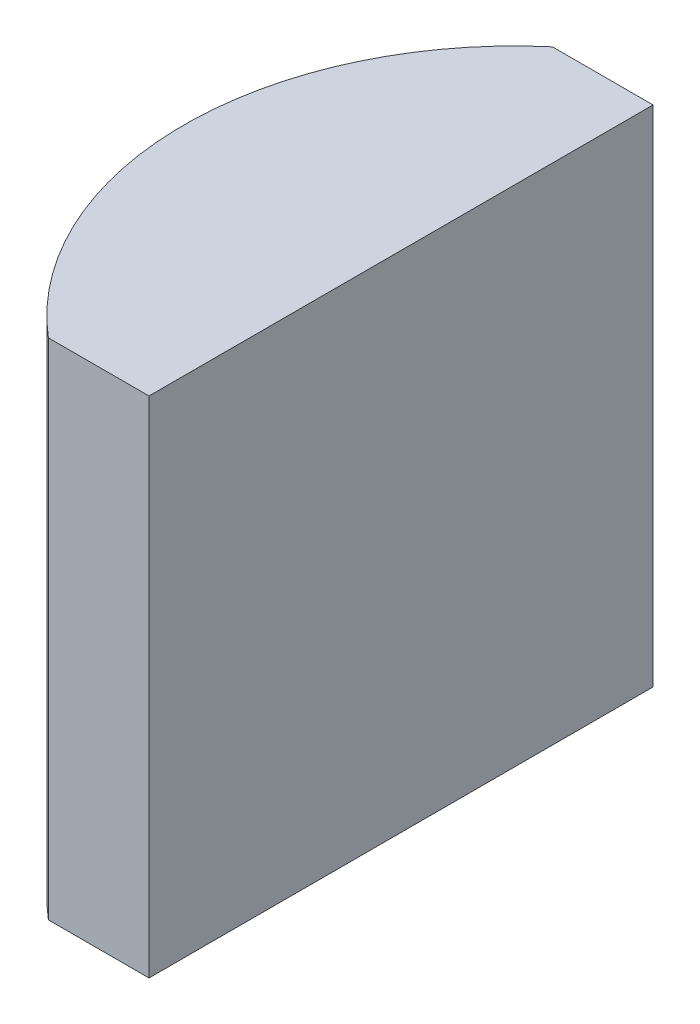
ISO-10303-21;
HEADER;
FILE_DESCRIPTION(('STEP AP214'),'2;1');
FILE_NAME('part.step','',(''),(''),'','','');
FILE_SCHEMA(('AUTOMOTIVE_DESIGN { 1 0 10303 214 1 1 1 1 }'));
ENDSEC;
DATA;
#1=APPLICATION_CONTEXT('core data for automotive mechanical design processes');
#2=APPLICATION_PROTOCOL_DEFINITION('international standard','automotive_design',2000,#1);
#3=PRODUCT_CONTEXT('',#1,'mechanical');
#4=PRODUCT('Part','Part','',(#3));
#5=PRODUCT_RELATED_PRODUCT_CATEGORY('part','',(#4));
#6=PRODUCT_DEFINITION_FORMATION('','',#4);
#7=PRODUCT_DEFINITION_CONTEXT('part definition',#1,'design');
#8=PRODUCT_DEFINITION('design','',#6,#7);
#9=PRODUCT_DEFINITION_SHAPE('','',#8);
#10=(LENGTH_UNIT() NAMED_UNIT(*) SI_UNIT(.MILLI.,.METRE.));
#11=(NAMED_UNIT(*) PLANE_ANGLE_UNIT() SI_UNIT($,.RADIAN.));
#12=(NAMED_UNIT(*) SI_UNIT($,.STERADIAN.) SOLID_ANGLE_UNIT());
#13=UNCERTAINTY_MEASURE_WITH_UNIT(LENGTH_MEASURE(1.E-05),#10,'distance_accuracy_value','');
#14=(GEOMETRIC_REPRESENTATION_CONTEXT(3) GLOBAL_UNCERTAINTY_ASSIGNED_CONTEXT((#13)) GLOBAL_UNIT_ASSIGNED_CONTEXT((#10,
#11,#12)) REPRESENTATION_CONTEXT('',''));
#15=CARTESIAN_POINT('',(0.,0.,0.));
#16=DIRECTION('',(0.,0.,1.));
#17=DIRECTION('',(1.,0.,0.));
#18=AXIS2_PLACEMENT_3D('',#15,#16,#17);
#19=CARTESIAN_POINT('',(4.35520433485127,10.,0.));
#20=DIRECTION('',(0.,-1.,0.));
#21=DIRECTION('',(0.,0.,-1.));
#22=AXIS2_PLACEMENT_3D('',#19,#20,#21);
#23=CYLINDRICAL_SURFACE('',#22,6.56);
#24=CARTESIAN_POINT('',(4.35520433485127,0.,0.));
#25=DIRECTION('',(0.,1.,0.));
#26=DIRECTION('',(0.,0.,1.));
#27=AXIS2_PLACEMENT_3D('',#24,#25,#26);
#28=CIRCLE('',#27,6.56);
#29=CARTESIAN_POINT('',(0.108605695940355,0.,-5.));
#30=VERTEX_POINT('',#29);
#31=CARTESIAN_POINT('',(0.108605695940354,0.,5.));
#32=VERTEX_POINT('',#31);
#33=EDGE_CURVE('E100',#30,#32,#28,.T.);
#34=ORIENTED_EDGE('',*,*,#33,.T.);
#35=DIRECTION('',(0.,-1.,0.));
#36=VECTOR('',#35,1.);
#37=CARTESIAN_POINT('',(0.108605695940354,10.,5.));
#38=LINE('',#37,#36);
#39=CARTESIAN_POINT('',(0.108605695940354,10.,5.));
#40=VERTEX_POINT('',#39);
#41=EDGE_CURVE('E11',#40,#32,#38,.T.);
#42=ORIENTED_EDGE('',*,*,#41,.F.);
#43=CARTESIAN_POINT('',(4.35520433485127,10.,0.));
#44=DIRECTION('',(0.,1.,0.));
#45=DIRECTION('',(0.,0.,1.));
#46=AXIS2_PLACEMENT_3D('',#43,#44,#45);
#47=CIRCLE('',#46,6.56);
#48=CARTESIAN_POINT('',(0.108605695940355,10.,-5.));
#49=VERTEX_POINT('',#48);
#50=EDGE_CURVE('E88',#49,#40,#47,.T.);
#51=ORIENTED_EDGE('',*,*,#50,.F.);
#52=DIRECTION('',(0.,-1.,0.));
#53=VECTOR('',#52,1.);
#54=CARTESIAN_POINT('',(0.108605695940355,10.,-5.));
#55=LINE('',#54,#53);
#56=EDGE_CURVE('E96',#49,#30,#55,.T.);
#57=ORIENTED_EDGE('',*,*,#56,.T.);
#58=EDGE_LOOP('',(#34,#42,#51,#57));
#59=FACE_BOUND('',#58,.T.);
#60=ADVANCED_FACE('F37',(#59),#23,.T.);
#61=CARTESIAN_POINT('',(0.108605695940354,10.,5.));
#62=DIRECTION('',(0.,0.,-1.));
#63=DIRECTION('',(-1.,0.,0.));
#64=AXIS2_PLACEMENT_3D('',#61,#62,#63);
#65=PLANE('',#64);
#66=DIRECTION('',(1.,0.,0.));
#67=VECTOR('',#66,1.);
#68=CARTESIAN_POINT('',(0.108605695940354,0.,5.));
#69=LINE('',#68,#67);
#70=CARTESIAN_POINT('',(2.10520433485127,0.,5.));
#71=VERTEX_POINT('',#70);
#72=EDGE_CURVE('E92',#32,#71,#69,.T.);
#73=ORIENTED_EDGE('',*,*,#72,.T.);
#74=DIRECTION('',(0.,-1.,0.));
#75=VECTOR('',#74,1.);
#76=CARTESIAN_POINT('',(2.10520433485127,10.,5.));
#77=LINE('',#76,#75);
#78=CARTESIAN_POINT('',(2.10520433485127,10.,5.));
#79=VERTEX_POINT('',#78);
#80=EDGE_CURVE('E45',#79,#71,#77,.T.);
#81=ORIENTED_EDGE('',*,*,#80,.F.);
#82=DIRECTION('',(1.,0.,0.));
#83=VECTOR('',#82,1.);
#84=CARTESIAN_POINT('',(0.108605695940354,10.,5.));
#85=LINE('',#84,#83);
#86=EDGE_CURVE('E83',#40,#79,#85,.T.);
#87=ORIENTED_EDGE('',*,*,#86,.F.);
#88=ORIENTED_EDGE('',*,*,#41,.T.);
#89=EDGE_LOOP('',(#73,#81,#87,#88));
#90=FACE_BOUND('',#89,.T.);
#91=ADVANCED_FACE('F91',(#90),#65,.F.);
#92=CARTESIAN_POINT('',(2.10520433485126,10.,-5.));
#93=DIRECTION('',(-1.,0.,0.));
#94=DIRECTION('',(0.,0.,1.));
#95=AXIS2_PLACEMENT_3D('',#92,#93,#94);
#96=PLANE('',#95);
#97=DIRECTION('',(0.,0.,-1.));
#98=VECTOR('',#97,1.);
#99=CARTESIAN_POINT('',(2.10520433485126,0.,-5.));
#100=LINE('',#99,#98);
#101=CARTESIAN_POINT('',(2.10520433485126,0.,-5.));
#102=VERTEX_POINT('',#101);
#103=EDGE_CURVE('E70',#71,#102,#100,.T.);
#104=ORIENTED_EDGE('',*,*,#103,.T.);
#105=DIRECTION('',(0.,-1.,0.));
#106=VECTOR('',#105,1.);
#107=CARTESIAN_POINT('',(2.10520433485126,10.,-5.));
#108=LINE('',#107,#106);
#109=CARTESIAN_POINT('',(2.10520433485126,10.,-5.));
#110=VERTEX_POINT('',#109);
#111=EDGE_CURVE('E93',#110,#102,#108,.T.);
#112=ORIENTED_EDGE('',*,*,#111,.F.);
#113=DIRECTION('',(0.,0.,-1.));
#114=VECTOR('',#113,1.);
#115=CARTESIAN_POINT('',(2.10520433485126,10.,-5.));
#116=LINE('',#115,#114);
#117=EDGE_CURVE('E86',#79,#110,#116,.T.);
#118=ORIENTED_EDGE('',*,*,#117,.F.);
#119=ORIENTED_EDGE('',*,*,#80,.T.);
#120=EDGE_LOOP('',(#104,#112,#118,#119));
#121=FACE_BOUND('',#120,.T.);
#122=ADVANCED_FACE('F94',(#121),#96,.F.);
#123=CARTESIAN_POINT('',(0.108605695940355,10.,-5.));
#124=DIRECTION('',(0.,0.,1.));
#125=DIRECTION('',(1.,0.,0.));
#126=AXIS2_PLACEMENT_3D('',#123,#124,#125);
#127=PLANE('',#126);
#128=DIRECTION('',(-1.,0.,0.));
#129=VECTOR('',#128,1.);
#130=CARTESIAN_POINT('',(0.108605695940355,0.,-5.));
#131=LINE('',#130,#129);
#132=EDGE_CURVE('E76',#102,#30,#131,.T.);
#133=ORIENTED_EDGE('',*,*,#132,.T.);
#134=ORIENTED_EDGE('',*,*,#56,.F.);
#135=DIRECTION('',(-1.,0.,0.));
#136=VECTOR('',#135,1.);
#137=CARTESIAN_POINT('',(0.108605695940355,10.,-5.));
#138=LINE('',#137,#136);
#139=EDGE_CURVE('E53',#110,#49,#138,.T.);
#140=ORIENTED_EDGE('',*,*,#139,.F.);
#141=ORIENTED_EDGE('',*,*,#111,.T.);
#142=EDGE_LOOP('',(#133,#134,#140,#141));
#143=FACE_BOUND('',#142,.T.);
#144=ADVANCED_FACE('F107',(#143),#127,.F.);
#145=CARTESIAN_POINT('',(4.35520433485127,10.,0.));
#146=DIRECTION('',(0.,1.,0.));
#147=DIRECTION('',(0.,0.,1.));
#148=AXIS2_PLACEMENT_3D('',#145,#146,#147);
#149=PLANE('',#148);
#150=ORIENTED_EDGE('',*,*,#50,.T.);
#151=ORIENTED_EDGE('',*,*,#86,.T.);
#152=ORIENTED_EDGE('',*,*,#117,.T.);
#153=ORIENTED_EDGE('',*,*,#139,.T.);
#154=EDGE_LOOP('',(#150,#151,#152,#153));
#155=FACE_BOUND('',#154,.T.);
#156=ADVANCED_FACE('F84',(#155),#149,.T.);
#157=CARTESIAN_POINT('',(4.35520433485127,0.,0.));
#158=DIRECTION('',(0.,1.,0.));
#159=DIRECTION('',(0.,0.,1.));
#160=AXIS2_PLACEMENT_3D('',#157,#158,#159);
#161=PLANE('',#160);
#162=ORIENTED_EDGE('',*,*,#33,.F.);
#163=ORIENTED_EDGE('',*,*,#132,.F.);
#164=ORIENTED_EDGE('',*,*,#103,.F.);
#165=ORIENTED_EDGE('',*,*,#72,.F.);
#166=EDGE_LOOP('',(#162,#163,#164,#165));
#167=FACE_BOUND('',#166,.T.);
#168=ADVANCED_FACE('F110',(#167),#161,.F.);
#169=CLOSED_SHELL('',(#60,#91,#122,#144,#156,#168));
#170=MANIFOLD_SOLID_BREP('B2',#169);
#171=ADVANCED_BREP_SHAPE_REPRESENTATION('',(#18,#170),#14);
#172=SHAPE_DEFINITION_REPRESENTATION(#9,#171);
ENDSEC;
END-ISO-10303-21;
